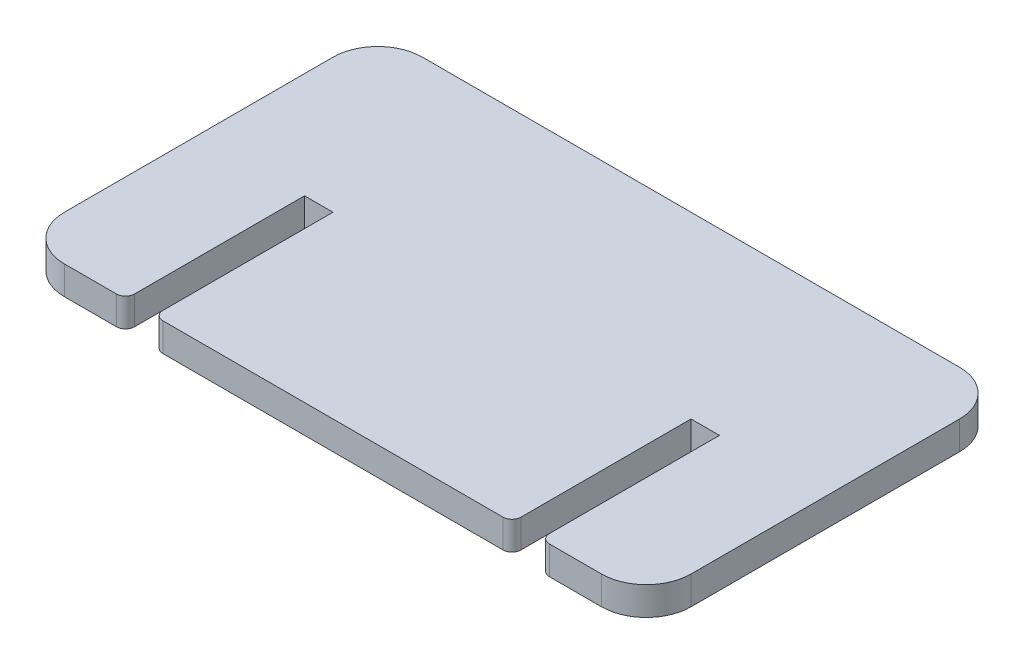
ISO-10303-21;
HEADER;
FILE_DESCRIPTION(('STEP AP214'),'2;1');
FILE_NAME('part.step','',(''),(''),'','','');
FILE_SCHEMA(('AUTOMOTIVE_DESIGN { 1 0 10303 214 1 1 1 1 }'));
ENDSEC;
DATA;
#1=APPLICATION_CONTEXT('core data for automotive mechanical design processes');
#2=APPLICATION_PROTOCOL_DEFINITION('international standard','automotive_design',2000,#1);
#3=PRODUCT_CONTEXT('',#1,'mechanical');
#4=PRODUCT('Part','Part','',(#3));
#5=PRODUCT_RELATED_PRODUCT_CATEGORY('part','',(#4));
#6=PRODUCT_DEFINITION_FORMATION('','',#4);
#7=PRODUCT_DEFINITION_CONTEXT('part definition',#1,'design');
#8=PRODUCT_DEFINITION('design','',#6,#7);
#9=PRODUCT_DEFINITION_SHAPE('','',#8);
#10=(LENGTH_UNIT() NAMED_UNIT(*) SI_UNIT(.MILLI.,.METRE.));
#11=(NAMED_UNIT(*) PLANE_ANGLE_UNIT() SI_UNIT($,.RADIAN.));
#12=(NAMED_UNIT(*) SI_UNIT($,.STERADIAN.) SOLID_ANGLE_UNIT());
#13=UNCERTAINTY_MEASURE_WITH_UNIT(LENGTH_MEASURE(1.E-05),#10,'distance_accuracy_value','');
#14=(GEOMETRIC_REPRESENTATION_CONTEXT(3) GLOBAL_UNCERTAINTY_ASSIGNED_CONTEXT((#13)) GLOBAL_UNIT_ASSIGNED_CONTEXT((#10,
#11,#12)) REPRESENTATION_CONTEXT('',''));
#15=CARTESIAN_POINT('',(0.,0.,0.));
#16=DIRECTION('',(0.,0.,1.));
#17=DIRECTION('',(1.,0.,0.));
#18=AXIS2_PLACEMENT_3D('',#15,#16,#17);
#19=CARTESIAN_POINT('',(5.00000000000004,3.175,0.));
#20=DIRECTION('',(0.,0.,-1.));
#21=DIRECTION('',(-1.,0.,0.));
#22=AXIS2_PLACEMENT_3D('',#19,#20,#21);
#23=PLANE('',#22);
#24=DIRECTION('',(1.,0.,0.));
#25=VECTOR('',#24,1.);
#26=CARTESIAN_POINT('',(5.00000000000004,3.175,0.));
#27=LINE('',#26,#25);
#28=CARTESIAN_POINT('',(59.175,3.175,0.));
#29=VERTEX_POINT('',#28);
#30=CARTESIAN_POINT('',(65.,3.175,0.));
#31=VERTEX_POINT('',#30);
#32=EDGE_CURVE('E242',#29,#31,#27,.T.);
#33=ORIENTED_EDGE('',*,*,#32,.F.);
#34=DIRECTION('',(0.,1.,0.));
#35=VECTOR('',#34,1.);
#36=CARTESIAN_POINT('',(59.175,3.175,0.));
#37=LINE('',#36,#35);
#38=CARTESIAN_POINT('',(59.175,0.,0.));
#39=VERTEX_POINT('',#38);
#40=EDGE_CURVE('E298',#29,#39,#37,.F.);
#41=ORIENTED_EDGE('',*,*,#40,.T.);
#42=DIRECTION('',(1.,0.,0.));
#43=VECTOR('',#42,1.);
#44=CARTESIAN_POINT('',(5.00000000000004,0.,0.));
#45=LINE('',#44,#43);
#46=CARTESIAN_POINT('',(65.,0.,0.));
#47=VERTEX_POINT('',#46);
#48=EDGE_CURVE('E262',#39,#47,#45,.T.);
#49=ORIENTED_EDGE('',*,*,#48,.T.);
#50=DIRECTION('',(0.,-1.,0.));
#51=VECTOR('',#50,1.);
#52=CARTESIAN_POINT('',(65.,3.175,0.));
#53=LINE('',#52,#51);
#54=EDGE_CURVE('E246',#31,#47,#53,.T.);
#55=ORIENTED_EDGE('',*,*,#54,.F.);
#56=EDGE_LOOP('',(#33,#41,#49,#55));
#57=FACE_BOUND('',#56,.T.);
#58=ADVANCED_FACE('F33',(#57),#23,.F.);
#59=CARTESIAN_POINT('',(5.,0.,0.));
#60=VERTEX_POINT('',#59);
#61=CARTESIAN_POINT('',(10.825,0.,0.));
#62=VERTEX_POINT('',#61);
#63=EDGE_CURVE('E230',#60,#62,#45,.T.);
#64=ORIENTED_EDGE('',*,*,#63,.T.);
#65=DIRECTION('',(0.,1.,0.));
#66=VECTOR('',#65,1.);
#67=CARTESIAN_POINT('',(10.825,3.175,0.));
#68=LINE('',#67,#66);
#69=CARTESIAN_POINT('',(10.825,3.175,0.));
#70=VERTEX_POINT('',#69);
#71=EDGE_CURVE('E41',#62,#70,#68,.T.);
#72=ORIENTED_EDGE('',*,*,#71,.T.);
#73=CARTESIAN_POINT('',(5.,3.175,0.));
#74=VERTEX_POINT('',#73);
#75=EDGE_CURVE('E243',#74,#70,#27,.T.);
#76=ORIENTED_EDGE('',*,*,#75,.F.);
#77=DIRECTION('',(0.,-1.,0.));
#78=VECTOR('',#77,1.);
#79=CARTESIAN_POINT('',(5.,3.175,0.));
#80=LINE('',#79,#78);
#81=EDGE_CURVE('E267',#74,#60,#80,.T.);
#82=ORIENTED_EDGE('',*,*,#81,.T.);
#83=EDGE_LOOP('',(#64,#72,#76,#82));
#84=FACE_BOUND('',#83,.T.);
#85=ADVANCED_FACE('F319',(#84),#23,.F.);
#86=CARTESIAN_POINT('',(65.,3.175,-5.));
#87=DIRECTION('',(0.,-1.,0.));
#88=DIRECTION('',(0.,0.,-1.));
#89=AXIS2_PLACEMENT_3D('',#86,#87,#88);
#90=CYLINDRICAL_SURFACE('',#89,5.);
#91=CARTESIAN_POINT('',(65.,0.,-5.));
#92=DIRECTION('',(0.,1.,0.));
#93=DIRECTION('',(0.,0.,-1.));
#94=AXIS2_PLACEMENT_3D('',#91,#92,#93);
#95=CIRCLE('',#94,5.);
#96=CARTESIAN_POINT('',(70.,0.,-5.00000000000004));
#97=VERTEX_POINT('',#96);
#98=EDGE_CURVE('E223',#47,#97,#95,.T.);
#99=ORIENTED_EDGE('',*,*,#98,.T.);
#100=DIRECTION('',(0.,-1.,0.));
#101=VECTOR('',#100,1.);
#102=CARTESIAN_POINT('',(70.,3.175,-5.00000000000004));
#103=LINE('',#102,#101);
#104=CARTESIAN_POINT('',(70.,3.175,-5.00000000000004));
#105=VERTEX_POINT('',#104);
#106=EDGE_CURVE('E285',#105,#97,#103,.T.);
#107=ORIENTED_EDGE('',*,*,#106,.F.);
#108=CARTESIAN_POINT('',(65.,3.175,-5.));
#109=DIRECTION('',(0.,1.,0.));
#110=DIRECTION('',(0.,0.,-1.));
#111=AXIS2_PLACEMENT_3D('',#108,#109,#110);
#112=CIRCLE('',#111,5.);
#113=EDGE_CURVE('E226',#31,#105,#112,.T.);
#114=ORIENTED_EDGE('',*,*,#113,.F.);
#115=ORIENTED_EDGE('',*,*,#54,.T.);
#116=EDGE_LOOP('',(#99,#107,#114,#115));
#117=FACE_BOUND('',#116,.T.);
#118=ADVANCED_FACE('F356',(#117),#90,.T.);
#119=CARTESIAN_POINT('',(70.,3.175,-5.00000000000004));
#120=DIRECTION('',(-1.,0.,0.));
#121=DIRECTION('',(0.,0.,1.));
#122=AXIS2_PLACEMENT_3D('',#119,#120,#121);
#123=PLANE('',#122);
#124=DIRECTION('',(0.,0.,-1.));
#125=VECTOR('',#124,1.);
#126=CARTESIAN_POINT('',(70.,0.,-5.00000000000004));
#127=LINE('',#126,#125);
#128=CARTESIAN_POINT('',(70.,0.,-35.));
#129=VERTEX_POINT('',#128);
#130=EDGE_CURVE('E250',#97,#129,#127,.T.);
#131=ORIENTED_EDGE('',*,*,#130,.T.);
#132=DIRECTION('',(0.,-1.,0.));
#133=VECTOR('',#132,1.);
#134=CARTESIAN_POINT('',(70.,3.175,-35.));
#135=LINE('',#134,#133);
#136=CARTESIAN_POINT('',(70.,3.175,-35.));
#137=VERTEX_POINT('',#136);
#138=EDGE_CURVE('E282',#137,#129,#135,.T.);
#139=ORIENTED_EDGE('',*,*,#138,.F.);
#140=DIRECTION('',(0.,0.,-1.));
#141=VECTOR('',#140,1.);
#142=CARTESIAN_POINT('',(70.,3.175,-5.00000000000004));
#143=LINE('',#142,#141);
#144=EDGE_CURVE('E229',#105,#137,#143,.T.);
#145=ORIENTED_EDGE('',*,*,#144,.F.);
#146=ORIENTED_EDGE('',*,*,#106,.T.);
#147=EDGE_LOOP('',(#131,#139,#145,#146));
#148=FACE_BOUND('',#147,.T.);
#149=ADVANCED_FACE('F352',(#148),#123,.F.);
#150=CARTESIAN_POINT('',(65.,3.175,-35.));
#151=DIRECTION('',(0.,-1.,0.));
#152=DIRECTION('',(0.,0.,-1.));
#153=AXIS2_PLACEMENT_3D('',#150,#151,#152);
#154=CYLINDRICAL_SURFACE('',#153,5.);
#155=CARTESIAN_POINT('',(65.,0.,-35.));
#156=DIRECTION('',(0.,1.,0.));
#157=DIRECTION('',(0.,0.,1.));
#158=AXIS2_PLACEMENT_3D('',#155,#156,#157);
#159=CIRCLE('',#158,5.);
#160=CARTESIAN_POINT('',(65.,0.,-40.));
#161=VERTEX_POINT('',#160);
#162=EDGE_CURVE('E252',#129,#161,#159,.T.);
#163=ORIENTED_EDGE('',*,*,#162,.T.);
#164=DIRECTION('',(0.,-1.,0.));
#165=VECTOR('',#164,1.);
#166=CARTESIAN_POINT('',(65.,3.175,-40.));
#167=LINE('',#166,#165);
#168=CARTESIAN_POINT('',(65.,3.175,-40.));
#169=VERTEX_POINT('',#168);
#170=EDGE_CURVE('E279',#169,#161,#167,.T.);
#171=ORIENTED_EDGE('',*,*,#170,.F.);
#172=CARTESIAN_POINT('',(65.,3.175,-35.));
#173=DIRECTION('',(0.,1.,0.));
#174=DIRECTION('',(0.,0.,1.));
#175=AXIS2_PLACEMENT_3D('',#172,#173,#174);
#176=CIRCLE('',#175,5.);
#177=EDGE_CURVE('E232',#137,#169,#176,.T.);
#178=ORIENTED_EDGE('',*,*,#177,.F.);
#179=ORIENTED_EDGE('',*,*,#138,.T.);
#180=EDGE_LOOP('',(#163,#171,#178,#179));
#181=FACE_BOUND('',#180,.T.);
#182=ADVANCED_FACE('F348',(#181),#154,.T.);
#183=CARTESIAN_POINT('',(5.00000000000004,3.175,-40.));
#184=DIRECTION('',(0.,0.,1.));
#185=DIRECTION('',(1.,0.,0.));
#186=AXIS2_PLACEMENT_3D('',#183,#184,#185);
#187=PLANE('',#186);
#188=DIRECTION('',(-1.,0.,0.));
#189=VECTOR('',#188,1.);
#190=CARTESIAN_POINT('',(5.00000000000004,0.,-40.));
#191=LINE('',#190,#189);
#192=CARTESIAN_POINT('',(5.00000000000004,0.,-40.));
#193=VERTEX_POINT('',#192);
#194=EDGE_CURVE('E254',#161,#193,#191,.T.);
#195=ORIENTED_EDGE('',*,*,#194,.T.);
#196=DIRECTION('',(0.,-1.,0.));
#197=VECTOR('',#196,1.);
#198=CARTESIAN_POINT('',(5.00000000000004,3.175,-40.));
#199=LINE('',#198,#197);
#200=CARTESIAN_POINT('',(5.00000000000004,3.175,-40.));
#201=VERTEX_POINT('',#200);
#202=EDGE_CURVE('E276',#201,#193,#199,.T.);
#203=ORIENTED_EDGE('',*,*,#202,.F.);
#204=DIRECTION('',(-1.,0.,0.));
#205=VECTOR('',#204,1.);
#206=CARTESIAN_POINT('',(5.00000000000004,3.175,-40.));
#207=LINE('',#206,#205);
#208=EDGE_CURVE('E234',#169,#201,#207,.T.);
#209=ORIENTED_EDGE('',*,*,#208,.F.);
#210=ORIENTED_EDGE('',*,*,#170,.T.);
#211=EDGE_LOOP('',(#195,#203,#209,#210));
#212=FACE_BOUND('',#211,.T.);
#213=ADVANCED_FACE('F343',(#212),#187,.F.);
#214=CARTESIAN_POINT('',(5.,3.175,-35.));
#215=DIRECTION('',(0.,-1.,0.));
#216=DIRECTION('',(0.,0.,-1.));
#217=AXIS2_PLACEMENT_3D('',#214,#215,#216);
#218=CYLINDRICAL_SURFACE('',#217,5.);
#219=CARTESIAN_POINT('',(5.,0.,-35.));
#220=DIRECTION('',(0.,1.,0.));
#221=DIRECTION('',(0.,0.,1.));
#222=AXIS2_PLACEMENT_3D('',#219,#220,#221);
#223=CIRCLE('',#222,5.);
#224=CARTESIAN_POINT('',(0.,0.,-35.));
#225=VERTEX_POINT('',#224);
#226=EDGE_CURVE('E256',#193,#225,#223,.T.);
#227=ORIENTED_EDGE('',*,*,#226,.T.);
#228=DIRECTION('',(0.,-1.,0.));
#229=VECTOR('',#228,1.);
#230=CARTESIAN_POINT('',(0.,3.175,-35.));
#231=LINE('',#230,#229);
#232=CARTESIAN_POINT('',(0.,3.175,-35.));
#233=VERTEX_POINT('',#232);
#234=EDGE_CURVE('E273',#233,#225,#231,.T.);
#235=ORIENTED_EDGE('',*,*,#234,.F.);
#236=CARTESIAN_POINT('',(5.,3.175,-35.));
#237=DIRECTION('',(0.,1.,0.));
#238=DIRECTION('',(0.,0.,1.));
#239=AXIS2_PLACEMENT_3D('',#236,#237,#238);
#240=CIRCLE('',#239,5.);
#241=EDGE_CURVE('E236',#201,#233,#240,.T.);
#242=ORIENTED_EDGE('',*,*,#241,.F.);
#243=ORIENTED_EDGE('',*,*,#202,.T.);
#244=EDGE_LOOP('',(#227,#235,#242,#243));
#245=FACE_BOUND('',#244,.T.);
#246=ADVANCED_FACE('F339',(#245),#218,.T.);
#247=CARTESIAN_POINT('',(0.,3.175,-5.00000000000004));
#248=DIRECTION('',(1.,0.,0.));
#249=DIRECTION('',(0.,0.,-1.));
#250=AXIS2_PLACEMENT_3D('',#247,#248,#249);
#251=PLANE('',#250);
#252=DIRECTION('',(0.,0.,1.));
#253=VECTOR('',#252,1.);
#254=CARTESIAN_POINT('',(0.,0.,-5.00000000000004));
#255=LINE('',#254,#253);
#256=CARTESIAN_POINT('',(0.,0.,-5.00000000000004));
#257=VERTEX_POINT('',#256);
#258=EDGE_CURVE('E258',#225,#257,#255,.T.);
#259=ORIENTED_EDGE('',*,*,#258,.T.);
#260=DIRECTION('',(0.,-1.,0.));
#261=VECTOR('',#260,1.);
#262=CARTESIAN_POINT('',(0.,3.175,-5.00000000000004));
#263=LINE('',#262,#261);
#264=CARTESIAN_POINT('',(0.,3.175,-5.00000000000004));
#265=VERTEX_POINT('',#264);
#266=EDGE_CURVE('E270',#265,#257,#263,.T.);
#267=ORIENTED_EDGE('',*,*,#266,.F.);
#268=DIRECTION('',(0.,0.,1.));
#269=VECTOR('',#268,1.);
#270=CARTESIAN_POINT('',(0.,3.175,-5.00000000000004));
#271=LINE('',#270,#269);
#272=EDGE_CURVE('E238',#233,#265,#271,.T.);
#273=ORIENTED_EDGE('',*,*,#272,.F.);
#274=ORIENTED_EDGE('',*,*,#234,.T.);
#275=EDGE_LOOP('',(#259,#267,#273,#274));
#276=FACE_BOUND('',#275,.T.);
#277=ADVANCED_FACE('F335',(#276),#251,.F.);
#278=CARTESIAN_POINT('',(5.,3.175,-5.));
#279=DIRECTION('',(0.,-1.,0.));
#280=DIRECTION('',(0.,0.,-1.));
#281=AXIS2_PLACEMENT_3D('',#278,#279,#280);
#282=CYLINDRICAL_SURFACE('',#281,5.);
#283=CARTESIAN_POINT('',(5.,0.,-5.));
#284=DIRECTION('',(0.,1.,0.));
#285=DIRECTION('',(0.,0.,1.));
#286=AXIS2_PLACEMENT_3D('',#283,#284,#285);
#287=CIRCLE('',#286,5.);
#288=EDGE_CURVE('E260',#257,#60,#287,.T.);
#289=ORIENTED_EDGE('',*,*,#288,.T.);
#290=ORIENTED_EDGE('',*,*,#81,.F.);
#291=CARTESIAN_POINT('',(5.,3.175,-5.));
#292=DIRECTION('',(0.,1.,0.));
#293=DIRECTION('',(0.,0.,1.));
#294=AXIS2_PLACEMENT_3D('',#291,#292,#293);
#295=CIRCLE('',#294,5.);
#296=EDGE_CURVE('E240',#265,#74,#295,.T.);
#297=ORIENTED_EDGE('',*,*,#296,.F.);
#298=ORIENTED_EDGE('',*,*,#266,.T.);
#299=EDGE_LOOP('',(#289,#290,#297,#298));
#300=FACE_BOUND('',#299,.T.);
#301=ADVANCED_FACE('F329',(#300),#282,.T.);
#302=CARTESIAN_POINT('',(16.,0.,0.));
#303=VERTEX_POINT('',#302);
#304=CARTESIAN_POINT('',(54.,0.,0.));
#305=VERTEX_POINT('',#304);
#306=EDGE_CURVE('E264',#303,#305,#45,.T.);
#307=ORIENTED_EDGE('',*,*,#306,.T.);
#308=DIRECTION('',(0.,1.,0.));
#309=VECTOR('',#308,1.);
#310=CARTESIAN_POINT('',(54.,3.175,0.));
#311=LINE('',#310,#309);
#312=CARTESIAN_POINT('',(54.,3.175,0.));
#313=VERTEX_POINT('',#312);
#314=EDGE_CURVE('E308',#305,#313,#311,.T.);
#315=ORIENTED_EDGE('',*,*,#314,.T.);
#316=CARTESIAN_POINT('',(16.,3.175,0.));
#317=VERTEX_POINT('',#316);
#318=EDGE_CURVE('E247',#317,#313,#27,.T.);
#319=ORIENTED_EDGE('',*,*,#318,.F.);
#320=DIRECTION('',(0.,1.,0.));
#321=VECTOR('',#320,1.);
#322=CARTESIAN_POINT('',(16.,3.175,0.));
#323=LINE('',#322,#321);
#324=EDGE_CURVE('E306',#317,#303,#323,.F.);
#325=ORIENTED_EDGE('',*,*,#324,.T.);
#326=EDGE_LOOP('',(#307,#315,#319,#325));
#327=FACE_BOUND('',#326,.T.);
#328=ADVANCED_FACE('F376',(#327),#23,.F.);
#329=CARTESIAN_POINT('',(65.,3.175,-5.));
#330=DIRECTION('',(0.,-1.,0.));
#331=DIRECTION('',(0.,0.,-1.));
#332=AXIS2_PLACEMENT_3D('',#329,#330,#331);
#333=PLANE('',#332);
#334=DIRECTION('',(0.,0.,-1.));
#335=VECTOR('',#334,1.);
#336=CARTESIAN_POINT('',(58.175,3.175,0.));
#337=LINE('',#336,#335);
#338=CARTESIAN_POINT('',(58.175,3.175,-1.));
#339=VERTEX_POINT('',#338);
#340=CARTESIAN_POINT('',(58.175,3.175,-20.));
#341=VERTEX_POINT('',#340);
#342=EDGE_CURVE('E188',#339,#341,#337,.T.);
#343=ORIENTED_EDGE('',*,*,#342,.F.);
#344=CARTESIAN_POINT('',(59.175,3.175,-1.));
#345=DIRECTION('',(0.,-1.,0.));
#346=DIRECTION('',(0.,0.,-1.));
#347=AXIS2_PLACEMENT_3D('',#344,#345,#346);
#348=CIRCLE('',#347,1.);
#349=EDGE_CURVE('E296',#339,#29,#348,.F.);
#350=ORIENTED_EDGE('',*,*,#349,.T.);
#351=ORIENTED_EDGE('',*,*,#32,.T.);
#352=ORIENTED_EDGE('',*,*,#113,.T.);
#353=ORIENTED_EDGE('',*,*,#144,.T.);
#354=ORIENTED_EDGE('',*,*,#177,.T.);
#355=ORIENTED_EDGE('',*,*,#208,.T.);
#356=ORIENTED_EDGE('',*,*,#241,.T.);
#357=ORIENTED_EDGE('',*,*,#272,.T.);
#358=ORIENTED_EDGE('',*,*,#296,.T.);
#359=ORIENTED_EDGE('',*,*,#75,.T.);
#360=CARTESIAN_POINT('',(10.825,3.175,-1.));
#361=DIRECTION('',(0.,-1.,0.));
#362=DIRECTION('',(0.,0.,-1.));
#363=AXIS2_PLACEMENT_3D('',#360,#361,#362);
#364=CIRCLE('',#363,1.);
#365=CARTESIAN_POINT('',(11.825,3.175,-1.));
#366=VERTEX_POINT('',#365);
#367=EDGE_CURVE('E290',#70,#366,#364,.F.);
#368=ORIENTED_EDGE('',*,*,#367,.T.);
#369=DIRECTION('',(0.,0.,1.));
#370=VECTOR('',#369,1.);
#371=CARTESIAN_POINT('',(11.825,3.175,0.));
#372=LINE('',#371,#370);
#373=CARTESIAN_POINT('',(11.825,3.175,-20.));
#374=VERTEX_POINT('',#373);
#375=EDGE_CURVE('E205',#374,#366,#372,.T.);
#376=ORIENTED_EDGE('',*,*,#375,.F.);
#377=DIRECTION('',(-1.,0.,0.));
#378=VECTOR('',#377,1.);
#379=CARTESIAN_POINT('',(11.825,3.175,-20.));
#380=LINE('',#379,#378);
#381=CARTESIAN_POINT('',(15.,3.175,-20.));
#382=VERTEX_POINT('',#381);
#383=EDGE_CURVE('E210',#382,#374,#380,.T.);
#384=ORIENTED_EDGE('',*,*,#383,.F.);
#385=DIRECTION('',(0.,0.,-1.));
#386=VECTOR('',#385,1.);
#387=CARTESIAN_POINT('',(15.,3.175,0.));
#388=LINE('',#387,#386);
#389=CARTESIAN_POINT('',(15.,3.175,-1.));
#390=VERTEX_POINT('',#389);
#391=EDGE_CURVE('E217',#390,#382,#388,.T.);
#392=ORIENTED_EDGE('',*,*,#391,.F.);
#393=CARTESIAN_POINT('',(16.,3.175,-1.));
#394=DIRECTION('',(0.,-1.,0.));
#395=DIRECTION('',(0.,0.,-1.));
#396=AXIS2_PLACEMENT_3D('',#393,#394,#395);
#397=CIRCLE('',#396,1.);
#398=EDGE_CURVE('E292',#390,#317,#397,.F.);
#399=ORIENTED_EDGE('',*,*,#398,.T.);
#400=ORIENTED_EDGE('',*,*,#318,.T.);
#401=CARTESIAN_POINT('',(54.,3.175,-1.));
#402=DIRECTION('',(0.,-1.,0.));
#403=DIRECTION('',(0.,0.,-1.));
#404=AXIS2_PLACEMENT_3D('',#401,#402,#403);
#405=CIRCLE('',#404,1.);
#406=CARTESIAN_POINT('',(55.,3.175,-1.));
#407=VERTEX_POINT('',#406);
#408=EDGE_CURVE('E294',#313,#407,#405,.F.);
#409=ORIENTED_EDGE('',*,*,#408,.T.);
#410=DIRECTION('',(0.,0.,1.));
#411=VECTOR('',#410,1.);
#412=CARTESIAN_POINT('',(55.,3.175,0.));
#413=LINE('',#412,#411);
#414=CARTESIAN_POINT('',(55.,3.175,-20.));
#415=VERTEX_POINT('',#414);
#416=EDGE_CURVE('E182',#415,#407,#413,.T.);
#417=ORIENTED_EDGE('',*,*,#416,.F.);
#418=DIRECTION('',(-1.,0.,0.));
#419=VECTOR('',#418,1.);
#420=CARTESIAN_POINT('',(58.175,3.175,-20.));
#421=LINE('',#420,#419);
#422=EDGE_CURVE('E201',#341,#415,#421,.T.);
#423=ORIENTED_EDGE('',*,*,#422,.F.);
#424=EDGE_LOOP('',(#343,#350,#351,#352,#353,#354,#355,#356,#357,#358,#359,#368,#376,#384,#392,
#399,#400,#409,#417,#423));
#425=FACE_BOUND('',#424,.T.);
#426=ADVANCED_FACE('F322',(#425),#333,.F.);
#427=CARTESIAN_POINT('',(65.,0.,-5.));
#428=DIRECTION('',(0.,-1.,0.));
#429=DIRECTION('',(0.,0.,-1.));
#430=AXIS2_PLACEMENT_3D('',#427,#428,#429);
#431=PLANE('',#430);
#432=ORIENTED_EDGE('',*,*,#48,.F.);
#433=CARTESIAN_POINT('',(59.175,0.,-1.));
#434=DIRECTION('',(0.,-1.,0.));
#435=DIRECTION('',(0.,0.,-1.));
#436=AXIS2_PLACEMENT_3D('',#433,#434,#435);
#437=CIRCLE('',#436,1.);
#438=CARTESIAN_POINT('',(58.175,0.,-1.));
#439=VERTEX_POINT('',#438);
#440=EDGE_CURVE('E178',#39,#439,#437,.T.);
#441=ORIENTED_EDGE('',*,*,#440,.T.);
#442=DIRECTION('',(0.,0.,-1.));
#443=VECTOR('',#442,1.);
#444=CARTESIAN_POINT('',(58.175,0.,0.));
#445=LINE('',#444,#443);
#446=CARTESIAN_POINT('',(58.175,0.,-20.));
#447=VERTEX_POINT('',#446);
#448=EDGE_CURVE('E170',#439,#447,#445,.T.);
#449=ORIENTED_EDGE('',*,*,#448,.T.);
#450=DIRECTION('',(-1.,0.,0.));
#451=VECTOR('',#450,1.);
#452=CARTESIAN_POINT('',(58.175,0.,-20.));
#453=LINE('',#452,#451);
#454=CARTESIAN_POINT('',(55.,0.,-20.));
#455=VERTEX_POINT('',#454);
#456=EDGE_CURVE('E176',#447,#455,#453,.T.);
#457=ORIENTED_EDGE('',*,*,#456,.T.);
#458=DIRECTION('',(0.,0.,1.));
#459=VECTOR('',#458,1.);
#460=CARTESIAN_POINT('',(55.,0.,0.));
#461=LINE('',#460,#459);
#462=CARTESIAN_POINT('',(55.,0.,-1.));
#463=VERTEX_POINT('',#462);
#464=EDGE_CURVE('E193',#455,#463,#461,.T.);
#465=ORIENTED_EDGE('',*,*,#464,.T.);
#466=CARTESIAN_POINT('',(54.,0.,-1.));
#467=DIRECTION('',(0.,-1.,0.));
#468=DIRECTION('',(0.,0.,-1.));
#469=AXIS2_PLACEMENT_3D('',#466,#467,#468);
#470=CIRCLE('',#469,1.);
#471=EDGE_CURVE('E303',#463,#305,#470,.T.);
#472=ORIENTED_EDGE('',*,*,#471,.T.);
#473=ORIENTED_EDGE('',*,*,#306,.F.);
#474=CARTESIAN_POINT('',(16.,0.,-1.));
#475=DIRECTION('',(0.,-1.,0.));
#476=DIRECTION('',(0.,0.,-1.));
#477=AXIS2_PLACEMENT_3D('',#474,#475,#476);
#478=CIRCLE('',#477,1.);
#479=CARTESIAN_POINT('',(15.,0.,-1.));
#480=VERTEX_POINT('',#479);
#481=EDGE_CURVE('E301',#303,#480,#478,.T.);
#482=ORIENTED_EDGE('',*,*,#481,.T.);
#483=DIRECTION('',(0.,0.,-1.));
#484=VECTOR('',#483,1.);
#485=CARTESIAN_POINT('',(15.,0.,0.));
#486=LINE('',#485,#484);
#487=CARTESIAN_POINT('',(15.,0.,-20.));
#488=VERTEX_POINT('',#487);
#489=EDGE_CURVE('E209',#480,#488,#486,.T.);
#490=ORIENTED_EDGE('',*,*,#489,.T.);
#491=DIRECTION('',(-1.,0.,0.));
#492=VECTOR('',#491,1.);
#493=CARTESIAN_POINT('',(11.825,0.,-20.));
#494=LINE('',#493,#492);
#495=CARTESIAN_POINT('',(11.825,0.,-20.));
#496=VERTEX_POINT('',#495);
#497=EDGE_CURVE('E212',#488,#496,#494,.T.);
#498=ORIENTED_EDGE('',*,*,#497,.T.);
#499=DIRECTION('',(0.,0.,1.));
#500=VECTOR('',#499,1.);
#501=CARTESIAN_POINT('',(11.825,0.,0.));
#502=LINE('',#501,#500);
#503=CARTESIAN_POINT('',(11.825,0.,-1.));
#504=VERTEX_POINT('',#503);
#505=EDGE_CURVE('E207',#496,#504,#502,.T.);
#506=ORIENTED_EDGE('',*,*,#505,.T.);
#507=CARTESIAN_POINT('',(10.825,0.,-1.));
#508=DIRECTION('',(0.,-1.,0.));
#509=DIRECTION('',(0.,0.,-1.));
#510=AXIS2_PLACEMENT_3D('',#507,#508,#509);
#511=CIRCLE('',#510,1.);
#512=EDGE_CURVE('E48',#504,#62,#511,.T.);
#513=ORIENTED_EDGE('',*,*,#512,.T.);
#514=ORIENTED_EDGE('',*,*,#63,.F.);
#515=ORIENTED_EDGE('',*,*,#288,.F.);
#516=ORIENTED_EDGE('',*,*,#258,.F.);
#517=ORIENTED_EDGE('',*,*,#226,.F.);
#518=ORIENTED_EDGE('',*,*,#194,.F.);
#519=ORIENTED_EDGE('',*,*,#162,.F.);
#520=ORIENTED_EDGE('',*,*,#130,.F.);
#521=ORIENTED_EDGE('',*,*,#98,.F.);
#522=EDGE_LOOP('',(#432,#441,#449,#457,#465,#472,#473,#482,#490,#498,#506,#513,#514,#515,#516,
#517,#518,#519,#520,#521));
#523=FACE_BOUND('',#522,.T.);
#524=ADVANCED_FACE('F173',(#523),#431,.T.);
#525=CARTESIAN_POINT('',(11.825,0.,0.));
#526=DIRECTION('',(-1.,0.,0.));
#527=DIRECTION('',(0.,0.,1.));
#528=AXIS2_PLACEMENT_3D('',#525,#526,#527);
#529=PLANE('',#528);
#530=ORIENTED_EDGE('',*,*,#375,.T.);
#531=DIRECTION('',(0.,1.,0.));
#532=VECTOR('',#531,1.);
#533=CARTESIAN_POINT('',(11.825,0.,-1.));
#534=LINE('',#533,#532);
#535=EDGE_CURVE('E11',#366,#504,#534,.F.);
#536=ORIENTED_EDGE('',*,*,#535,.T.);
#537=ORIENTED_EDGE('',*,*,#505,.F.);
#538=DIRECTION('',(0.,1.,0.));
#539=VECTOR('',#538,1.);
#540=CARTESIAN_POINT('',(11.825,0.,-20.));
#541=LINE('',#540,#539);
#542=EDGE_CURVE('E221',#496,#374,#541,.T.);
#543=ORIENTED_EDGE('',*,*,#542,.T.);
#544=EDGE_LOOP('',(#530,#536,#537,#543));
#545=FACE_BOUND('',#544,.T.);
#546=ADVANCED_FACE('F391',(#545),#529,.F.);
#547=CARTESIAN_POINT('',(11.825,0.,-20.));
#548=DIRECTION('',(0.,0.,-1.));
#549=DIRECTION('',(-1.,0.,0.));
#550=AXIS2_PLACEMENT_3D('',#547,#548,#549);
#551=PLANE('',#550);
#552=ORIENTED_EDGE('',*,*,#383,.T.);
#553=ORIENTED_EDGE('',*,*,#542,.F.);
#554=ORIENTED_EDGE('',*,*,#497,.F.);
#555=DIRECTION('',(0.,1.,0.));
#556=VECTOR('',#555,1.);
#557=CARTESIAN_POINT('',(15.,0.,-20.));
#558=LINE('',#557,#556);
#559=EDGE_CURVE('E215',#488,#382,#558,.T.);
#560=ORIENTED_EDGE('',*,*,#559,.T.);
#561=EDGE_LOOP('',(#552,#553,#554,#560));
#562=FACE_BOUND('',#561,.T.);
#563=ADVANCED_FACE('F390',(#562),#551,.F.);
#564=CARTESIAN_POINT('',(15.,0.,0.));
#565=DIRECTION('',(1.,0.,0.));
#566=DIRECTION('',(0.,0.,-1.));
#567=AXIS2_PLACEMENT_3D('',#564,#565,#566);
#568=PLANE('',#567);
#569=ORIENTED_EDGE('',*,*,#489,.F.);
#570=DIRECTION('',(0.,1.,0.));
#571=VECTOR('',#570,1.);
#572=CARTESIAN_POINT('',(15.,0.,-1.));
#573=LINE('',#572,#571);
#574=EDGE_CURVE('E313',#480,#390,#573,.T.);
#575=ORIENTED_EDGE('',*,*,#574,.T.);
#576=ORIENTED_EDGE('',*,*,#391,.T.);
#577=ORIENTED_EDGE('',*,*,#559,.F.);
#578=EDGE_LOOP('',(#569,#575,#576,#577));
#579=FACE_BOUND('',#578,.T.);
#580=ADVANCED_FACE('F386',(#579),#568,.F.);
#581=CARTESIAN_POINT('',(58.175,0.,0.));
#582=DIRECTION('',(1.,0.,0.));
#583=DIRECTION('',(0.,0.,-1.));
#584=AXIS2_PLACEMENT_3D('',#581,#582,#583);
#585=PLANE('',#584);
#586=ORIENTED_EDGE('',*,*,#448,.F.);
#587=DIRECTION('',(0.,1.,0.));
#588=VECTOR('',#587,1.);
#589=CARTESIAN_POINT('',(58.175,0.,-1.));
#590=LINE('',#589,#588);
#591=EDGE_CURVE('E288',#439,#339,#590,.T.);
#592=ORIENTED_EDGE('',*,*,#591,.T.);
#593=ORIENTED_EDGE('',*,*,#342,.T.);
#594=DIRECTION('',(0.,1.,0.));
#595=VECTOR('',#594,1.);
#596=CARTESIAN_POINT('',(58.175,0.,-20.));
#597=LINE('',#596,#595);
#598=EDGE_CURVE('E185',#447,#341,#597,.T.);
#599=ORIENTED_EDGE('',*,*,#598,.F.);
#600=EDGE_LOOP('',(#586,#592,#593,#599));
#601=FACE_BOUND('',#600,.T.);
#602=ADVANCED_FACE('F186',(#601),#585,.F.);
#603=CARTESIAN_POINT('',(55.,0.,0.));
#604=DIRECTION('',(-1.,0.,0.));
#605=DIRECTION('',(0.,0.,1.));
#606=AXIS2_PLACEMENT_3D('',#603,#604,#605);
#607=PLANE('',#606);
#608=ORIENTED_EDGE('',*,*,#416,.T.);
#609=DIRECTION('',(0.,1.,0.));
#610=VECTOR('',#609,1.);
#611=CARTESIAN_POINT('',(55.,0.,-1.));
#612=LINE('',#611,#610);
#613=EDGE_CURVE('E311',#407,#463,#612,.F.);
#614=ORIENTED_EDGE('',*,*,#613,.T.);
#615=ORIENTED_EDGE('',*,*,#464,.F.);
#616=DIRECTION('',(0.,1.,0.));
#617=VECTOR('',#616,1.);
#618=CARTESIAN_POINT('',(55.,0.,-20.));
#619=LINE('',#618,#617);
#620=EDGE_CURVE('E192',#455,#415,#619,.T.);
#621=ORIENTED_EDGE('',*,*,#620,.T.);
#622=EDGE_LOOP('',(#608,#614,#615,#621));
#623=FACE_BOUND('',#622,.T.);
#624=ADVANCED_FACE('F367',(#623),#607,.F.);
#625=CARTESIAN_POINT('',(58.175,0.,-20.));
#626=DIRECTION('',(0.,0.,-1.));
#627=DIRECTION('',(-1.,0.,0.));
#628=AXIS2_PLACEMENT_3D('',#625,#626,#627);
#629=PLANE('',#628);
#630=ORIENTED_EDGE('',*,*,#422,.T.);
#631=ORIENTED_EDGE('',*,*,#620,.F.);
#632=ORIENTED_EDGE('',*,*,#456,.F.);
#633=ORIENTED_EDGE('',*,*,#598,.T.);
#634=EDGE_LOOP('',(#630,#631,#632,#633));
#635=FACE_BOUND('',#634,.T.);
#636=ADVANCED_FACE('F196',(#635),#629,.F.);
#637=CARTESIAN_POINT('',(59.175,0.,-1.));
#638=DIRECTION('',(0.,1.,0.));
#639=DIRECTION('',(0.,0.,1.));
#640=AXIS2_PLACEMENT_3D('',#637,#638,#639);
#641=CYLINDRICAL_SURFACE('',#640,1.);
#642=ORIENTED_EDGE('',*,*,#440,.F.);
#643=ORIENTED_EDGE('',*,*,#40,.F.);
#644=ORIENTED_EDGE('',*,*,#349,.F.);
#645=ORIENTED_EDGE('',*,*,#591,.F.);
#646=EDGE_LOOP('',(#642,#643,#644,#645));
#647=FACE_BOUND('',#646,.T.);
#648=ADVANCED_FACE('F361',(#647),#641,.T.);
#649=CARTESIAN_POINT('',(54.,3.175,-1.));
#650=DIRECTION('',(0.,1.,0.));
#651=DIRECTION('',(0.,0.,1.));
#652=AXIS2_PLACEMENT_3D('',#649,#650,#651);
#653=CYLINDRICAL_SURFACE('',#652,1.);
#654=ORIENTED_EDGE('',*,*,#471,.F.);
#655=ORIENTED_EDGE('',*,*,#613,.F.);
#656=ORIENTED_EDGE('',*,*,#408,.F.);
#657=ORIENTED_EDGE('',*,*,#314,.F.);
#658=EDGE_LOOP('',(#654,#655,#656,#657));
#659=FACE_BOUND('',#658,.T.);
#660=ADVANCED_FACE('F370',(#659),#653,.T.);
#661=CARTESIAN_POINT('',(16.,0.,-1.));
#662=DIRECTION('',(0.,1.,0.));
#663=DIRECTION('',(0.,0.,1.));
#664=AXIS2_PLACEMENT_3D('',#661,#662,#663);
#665=CYLINDRICAL_SURFACE('',#664,1.);
#666=ORIENTED_EDGE('',*,*,#481,.F.);
#667=ORIENTED_EDGE('',*,*,#324,.F.);
#668=ORIENTED_EDGE('',*,*,#398,.F.);
#669=ORIENTED_EDGE('',*,*,#574,.F.);
#670=EDGE_LOOP('',(#666,#667,#668,#669));
#671=FACE_BOUND('',#670,.T.);
#672=ADVANCED_FACE('F380',(#671),#665,.T.);
#673=CARTESIAN_POINT('',(10.825,3.175,-1.));
#674=DIRECTION('',(0.,1.,0.));
#675=DIRECTION('',(0.,0.,1.));
#676=AXIS2_PLACEMENT_3D('',#673,#674,#675);
#677=CYLINDRICAL_SURFACE('',#676,1.);
#678=ORIENTED_EDGE('',*,*,#512,.F.);
#679=ORIENTED_EDGE('',*,*,#535,.F.);
#680=ORIENTED_EDGE('',*,*,#367,.F.);
#681=ORIENTED_EDGE('',*,*,#71,.F.);
#682=EDGE_LOOP('',(#678,#679,#680,#681));
#683=FACE_BOUND('',#682,.T.);
#684=ADVANCED_FACE('F35',(#683),#677,.T.);
#685=CLOSED_SHELL('',(#58,#85,#118,#149,#182,#213,#246,#277,#301,#328,#426,#524,#546,#563,#580,
#602,#624,#636,#648,#660,#672,#684));
#686=MANIFOLD_SOLID_BREP('B2',#685);
#687=ADVANCED_BREP_SHAPE_REPRESENTATION('',(#18,#686),#14);
#688=SHAPE_DEFINITION_REPRESENTATION(#9,#687);
ENDSEC;
END-ISO-10303-21;
